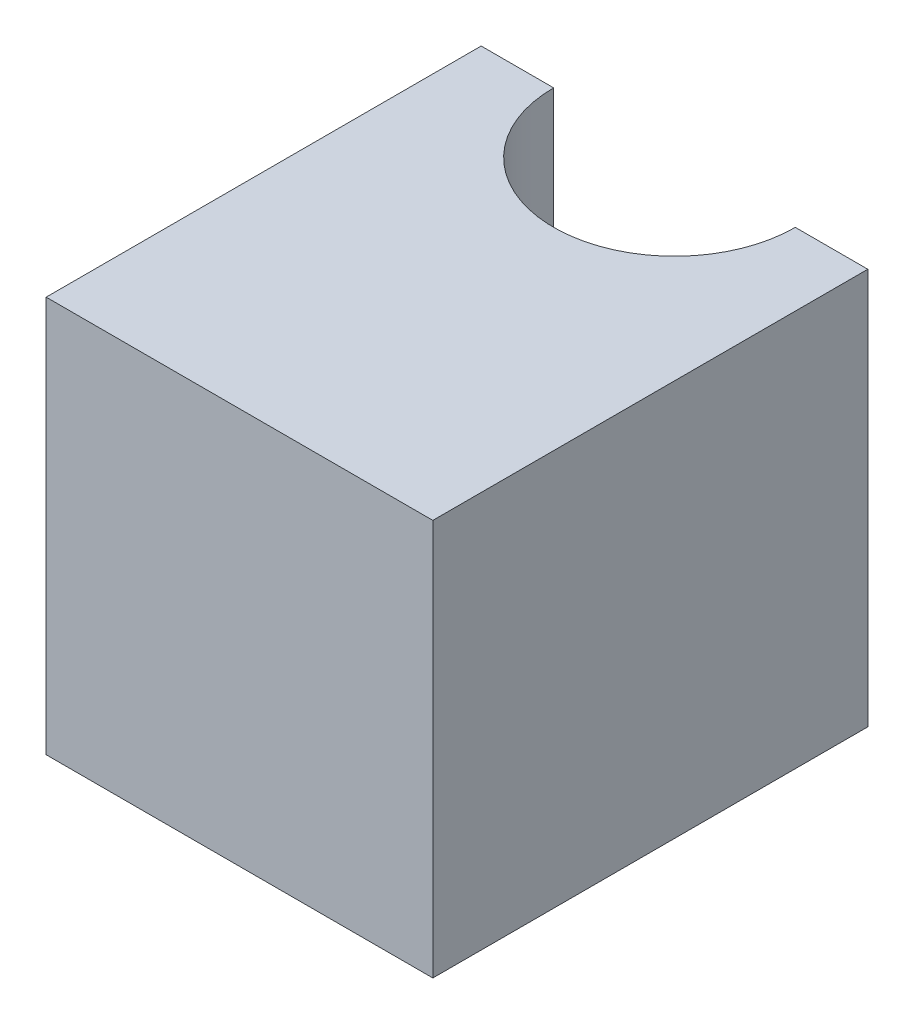
ISO-10303-21;
HEADER;
FILE_DESCRIPTION(('STEP AP214'),'2;1');
FILE_NAME('part.step','',(''),(''),'','','');
FILE_SCHEMA(('AUTOMOTIVE_DESIGN { 1 0 10303 214 1 1 1 1 }'));
ENDSEC;
DATA;
#1=APPLICATION_CONTEXT('core data for automotive mechanical design processes');
#2=APPLICATION_PROTOCOL_DEFINITION('international standard','automotive_design',2000,#1);
#3=PRODUCT_CONTEXT('',#1,'mechanical');
#4=PRODUCT('Part','Part','',(#3));
#5=PRODUCT_RELATED_PRODUCT_CATEGORY('part','',(#4));
#6=PRODUCT_DEFINITION_FORMATION('','',#4);
#7=PRODUCT_DEFINITION_CONTEXT('part definition',#1,'design');
#8=PRODUCT_DEFINITION('design','',#6,#7);
#9=PRODUCT_DEFINITION_SHAPE('','',#8);
#10=(LENGTH_UNIT() NAMED_UNIT(*) SI_UNIT(.MILLI.,.METRE.));
#11=(NAMED_UNIT(*) PLANE_ANGLE_UNIT() SI_UNIT($,.RADIAN.));
#12=(NAMED_UNIT(*) SI_UNIT($,.STERADIAN.) SOLID_ANGLE_UNIT());
#13=UNCERTAINTY_MEASURE_WITH_UNIT(LENGTH_MEASURE(1.E-05),#10,'distance_accuracy_value','');
#14=(GEOMETRIC_REPRESENTATION_CONTEXT(3) GLOBAL_UNCERTAINTY_ASSIGNED_CONTEXT((#13)) GLOBAL_UNIT_ASSIGNED_CONTEXT((#10,
#11,#12)) REPRESENTATION_CONTEXT('',''));
#15=CARTESIAN_POINT('',(0.,0.,0.));
#16=DIRECTION('',(0.,0.,1.));
#17=DIRECTION('',(1.,0.,0.));
#18=AXIS2_PLACEMENT_3D('',#15,#16,#17);
#19=CARTESIAN_POINT('',(-2.6,0.,-6.1));
#20=DIRECTION('',(0.,1.,0.));
#21=DIRECTION('',(0.,0.,1.));
#22=AXIS2_PLACEMENT_3D('',#19,#20,#21);
#23=CYLINDRICAL_SURFACE('',#22,0.25);
#24=DIRECTION('',(0.,1.,0.));
#25=VECTOR('',#24,1.);
#26=CARTESIAN_POINT('',(-2.85,0.,-6.1));
#27=LINE('',#26,#25);
#28=CARTESIAN_POINT('',(-2.85,0.82,-6.1));
#29=VERTEX_POINT('',#28);
#30=CARTESIAN_POINT('',(-2.85,0.,-6.1));
#31=VERTEX_POINT('',#30);
#32=EDGE_CURVE('E119',#29,#31,#27,.F.);
#33=ORIENTED_EDGE('',*,*,#32,.F.);
#34=CARTESIAN_POINT('',(-2.6,0.82,-6.1));
#35=DIRECTION('',(0.,1.,0.));
#36=DIRECTION('',(0.,0.,1.));
#37=AXIS2_PLACEMENT_3D('',#34,#35,#36);
#38=CIRCLE('',#37,0.25);
#39=CARTESIAN_POINT('',(-2.35,0.82,-6.1));
#40=VERTEX_POINT('',#39);
#41=EDGE_CURVE('E80',#40,#29,#38,.F.);
#42=ORIENTED_EDGE('',*,*,#41,.F.);
#43=DIRECTION('',(0.,1.,0.));
#44=VECTOR('',#43,1.);
#45=CARTESIAN_POINT('',(-2.35,0.,-6.1));
#46=LINE('',#45,#44);
#47=CARTESIAN_POINT('',(-2.35,0.,-6.1));
#48=VERTEX_POINT('',#47);
#49=EDGE_CURVE('E78',#48,#40,#46,.T.);
#50=ORIENTED_EDGE('',*,*,#49,.F.);
#51=CARTESIAN_POINT('',(-2.6,0.,-6.1));
#52=DIRECTION('',(0.,1.,0.));
#53=DIRECTION('',(0.,0.,1.));
#54=AXIS2_PLACEMENT_3D('',#51,#52,#53);
#55=CIRCLE('',#54,0.25);
#56=EDGE_CURVE('E20',#48,#31,#55,.F.);
#57=ORIENTED_EDGE('',*,*,#56,.T.);
#58=EDGE_LOOP('',(#33,#42,#50,#57));
#59=FACE_BOUND('',#58,.T.);
#60=ADVANCED_FACE('F17',(#59),#23,.F.);
#61=CARTESIAN_POINT('',(-2.85,0.,-6.1));
#62=DIRECTION('',(0.,0.,-1.));
#63=DIRECTION('',(-1.,0.,0.));
#64=AXIS2_PLACEMENT_3D('',#61,#62,#63);
#65=PLANE('',#64);
#66=DIRECTION('',(1.,0.,0.));
#67=VECTOR('',#66,1.);
#68=CARTESIAN_POINT('',(-2.6,0.82,-6.1));
#69=LINE('',#68,#67);
#70=CARTESIAN_POINT('',(-3.,0.82,-6.1));
#71=VERTEX_POINT('',#70);
#72=EDGE_CURVE('E104',#29,#71,#69,.F.);
#73=ORIENTED_EDGE('',*,*,#72,.F.);
#74=ORIENTED_EDGE('',*,*,#32,.T.);
#75=DIRECTION('',(1.,0.,0.));
#76=VECTOR('',#75,1.);
#77=CARTESIAN_POINT('',(-2.6,0.,-6.1));
#78=LINE('',#77,#76);
#79=CARTESIAN_POINT('',(-3.,0.,-6.1));
#80=VERTEX_POINT('',#79);
#81=EDGE_CURVE('E73',#31,#80,#78,.F.);
#82=ORIENTED_EDGE('',*,*,#81,.T.);
#83=DIRECTION('',(0.,1.,0.));
#84=VECTOR('',#83,1.);
#85=CARTESIAN_POINT('',(-3.,0.,-6.1));
#86=LINE('',#85,#84);
#87=EDGE_CURVE('E76',#71,#80,#86,.F.);
#88=ORIENTED_EDGE('',*,*,#87,.F.);
#89=EDGE_LOOP('',(#73,#74,#82,#88));
#90=FACE_BOUND('',#89,.T.);
#91=ADVANCED_FACE('F196',(#90),#65,.T.);
#92=CARTESIAN_POINT('',(-3.,0.,-6.1));
#93=DIRECTION('',(-1.,0.,0.));
#94=DIRECTION('',(0.,0.,1.));
#95=AXIS2_PLACEMENT_3D('',#92,#93,#94);
#96=PLANE('',#95);
#97=DIRECTION('',(0.,0.,1.));
#98=VECTOR('',#97,1.);
#99=CARTESIAN_POINT('',(-3.,0.82,-5.65));
#100=LINE('',#99,#98);
#101=CARTESIAN_POINT('',(-3.,0.82,-5.2));
#102=VERTEX_POINT('',#101);
#103=EDGE_CURVE('E83',#71,#102,#100,.T.);
#104=ORIENTED_EDGE('',*,*,#103,.F.);
#105=ORIENTED_EDGE('',*,*,#87,.T.);
#106=DIRECTION('',(0.,0.,1.));
#107=VECTOR('',#106,1.);
#108=CARTESIAN_POINT('',(-3.,0.,-5.65));
#109=LINE('',#108,#107);
#110=CARTESIAN_POINT('',(-3.,0.,-5.2));
#111=VERTEX_POINT('',#110);
#112=EDGE_CURVE('E89',#80,#111,#109,.T.);
#113=ORIENTED_EDGE('',*,*,#112,.T.);
#114=DIRECTION('',(0.,1.,0.));
#115=VECTOR('',#114,1.);
#116=CARTESIAN_POINT('',(-3.,0.,-5.2));
#117=LINE('',#116,#115);
#118=EDGE_CURVE('E100',#102,#111,#117,.F.);
#119=ORIENTED_EDGE('',*,*,#118,.F.);
#120=EDGE_LOOP('',(#104,#105,#113,#119));
#121=FACE_BOUND('',#120,.T.);
#122=ADVANCED_FACE('F187',(#121),#96,.T.);
#123=CARTESIAN_POINT('',(-2.6,0.,-5.65));
#124=DIRECTION('',(0.,1.,0.));
#125=DIRECTION('',(0.,0.,1.));
#126=AXIS2_PLACEMENT_3D('',#123,#124,#125);
#127=PLANE('',#126);
#128=ORIENTED_EDGE('',*,*,#81,.F.);
#129=ORIENTED_EDGE('',*,*,#56,.F.);
#130=DIRECTION('',(-1.,0.,0.));
#131=VECTOR('',#130,1.);
#132=CARTESIAN_POINT('',(-2.2,0.,-6.1));
#133=LINE('',#132,#131);
#134=CARTESIAN_POINT('',(-2.2,0.,-6.1));
#135=VERTEX_POINT('',#134);
#136=EDGE_CURVE('E70',#135,#48,#133,.T.);
#137=ORIENTED_EDGE('',*,*,#136,.F.);
#138=DIRECTION('',(0.,0.,-1.));
#139=VECTOR('',#138,1.);
#140=CARTESIAN_POINT('',(-2.2,0.,-5.2));
#141=LINE('',#140,#139);
#142=CARTESIAN_POINT('',(-2.2,0.,-5.2));
#143=VERTEX_POINT('',#142);
#144=EDGE_CURVE('E98',#143,#135,#141,.T.);
#145=ORIENTED_EDGE('',*,*,#144,.F.);
#146=DIRECTION('',(1.,0.,0.));
#147=VECTOR('',#146,1.);
#148=CARTESIAN_POINT('',(-3.,0.,-5.2));
#149=LINE('',#148,#147);
#150=EDGE_CURVE('E107',#111,#143,#149,.T.);
#151=ORIENTED_EDGE('',*,*,#150,.F.);
#152=ORIENTED_EDGE('',*,*,#112,.F.);
#153=EDGE_LOOP('',(#128,#129,#137,#145,#151,#152));
#154=FACE_BOUND('',#153,.T.);
#155=ADVANCED_FACE('F68',(#154),#127,.F.);
#156=CARTESIAN_POINT('',(-2.2,0.,-6.1));
#157=DIRECTION('',(0.,0.,-1.));
#158=DIRECTION('',(-1.,0.,0.));
#159=AXIS2_PLACEMENT_3D('',#156,#157,#158);
#160=PLANE('',#159);
#161=DIRECTION('',(1.,0.,0.));
#162=VECTOR('',#161,1.);
#163=CARTESIAN_POINT('',(-2.6,0.82,-6.1));
#164=LINE('',#163,#162);
#165=CARTESIAN_POINT('',(-2.2,0.82,-6.1));
#166=VERTEX_POINT('',#165);
#167=EDGE_CURVE('E105',#166,#40,#164,.F.);
#168=ORIENTED_EDGE('',*,*,#167,.F.);
#169=DIRECTION('',(0.,1.,0.));
#170=VECTOR('',#169,1.);
#171=CARTESIAN_POINT('',(-2.2,0.,-6.1));
#172=LINE('',#171,#170);
#173=EDGE_CURVE('E87',#135,#166,#172,.T.);
#174=ORIENTED_EDGE('',*,*,#173,.F.);
#175=ORIENTED_EDGE('',*,*,#136,.T.);
#176=ORIENTED_EDGE('',*,*,#49,.T.);
#177=EDGE_LOOP('',(#168,#174,#175,#176));
#178=FACE_BOUND('',#177,.T.);
#179=ADVANCED_FACE('F85',(#178),#160,.T.);
#180=CARTESIAN_POINT('',(-2.6,0.82,-5.65));
#181=DIRECTION('',(0.,1.,0.));
#182=DIRECTION('',(0.,0.,1.));
#183=AXIS2_PLACEMENT_3D('',#180,#181,#182);
#184=PLANE('',#183);
#185=ORIENTED_EDGE('',*,*,#41,.T.);
#186=ORIENTED_EDGE('',*,*,#72,.T.);
#187=ORIENTED_EDGE('',*,*,#103,.T.);
#188=DIRECTION('',(1.,0.,0.));
#189=VECTOR('',#188,1.);
#190=CARTESIAN_POINT('',(-3.,0.82,-5.2));
#191=LINE('',#190,#189);
#192=CARTESIAN_POINT('',(-2.2,0.82,-5.2));
#193=VERTEX_POINT('',#192);
#194=EDGE_CURVE('E35',#193,#102,#191,.F.);
#195=ORIENTED_EDGE('',*,*,#194,.F.);
#196=DIRECTION('',(0.,0.,-1.));
#197=VECTOR('',#196,1.);
#198=CARTESIAN_POINT('',(-2.2,0.82,-5.2));
#199=LINE('',#198,#197);
#200=EDGE_CURVE('E26',#166,#193,#199,.F.);
#201=ORIENTED_EDGE('',*,*,#200,.F.);
#202=ORIENTED_EDGE('',*,*,#167,.T.);
#203=EDGE_LOOP('',(#185,#186,#187,#195,#201,#202));
#204=FACE_BOUND('',#203,.T.);
#205=ADVANCED_FACE('F145',(#204),#184,.T.);
#206=CARTESIAN_POINT('',(-3.,0.,-5.2));
#207=DIRECTION('',(0.,0.,1.));
#208=DIRECTION('',(1.,0.,0.));
#209=AXIS2_PLACEMENT_3D('',#206,#207,#208);
#210=PLANE('',#209);
#211=ORIENTED_EDGE('',*,*,#194,.T.);
#212=ORIENTED_EDGE('',*,*,#118,.T.);
#213=ORIENTED_EDGE('',*,*,#150,.T.);
#214=DIRECTION('',(0.,1.,0.));
#215=VECTOR('',#214,1.);
#216=CARTESIAN_POINT('',(-2.2,0.,-5.2));
#217=LINE('',#216,#215);
#218=EDGE_CURVE('E11',#193,#143,#217,.F.);
#219=ORIENTED_EDGE('',*,*,#218,.F.);
#220=EDGE_LOOP('',(#211,#212,#213,#219));
#221=FACE_BOUND('',#220,.T.);
#222=ADVANCED_FACE('F141',(#221),#210,.T.);
#223=CARTESIAN_POINT('',(-2.2,0.,-5.2));
#224=DIRECTION('',(1.,0.,0.));
#225=DIRECTION('',(0.,0.,-1.));
#226=AXIS2_PLACEMENT_3D('',#223,#224,#225);
#227=PLANE('',#226);
#228=ORIENTED_EDGE('',*,*,#200,.T.);
#229=ORIENTED_EDGE('',*,*,#218,.T.);
#230=ORIENTED_EDGE('',*,*,#144,.T.);
#231=ORIENTED_EDGE('',*,*,#173,.T.);
#232=EDGE_LOOP('',(#228,#229,#230,#231));
#233=FACE_BOUND('',#232,.T.);
#234=ADVANCED_FACE('F144',(#233),#227,.T.);
#235=CLOSED_SHELL('',(#60,#91,#122,#155,#179,#205,#222,#234));
#236=MANIFOLD_SOLID_BREP('B1',#235);
#237=ADVANCED_BREP_SHAPE_REPRESENTATION('',(#18,#236),#14);
#238=SHAPE_DEFINITION_REPRESENTATION(#9,#237);
ENDSEC;
END-ISO-10303-21;
